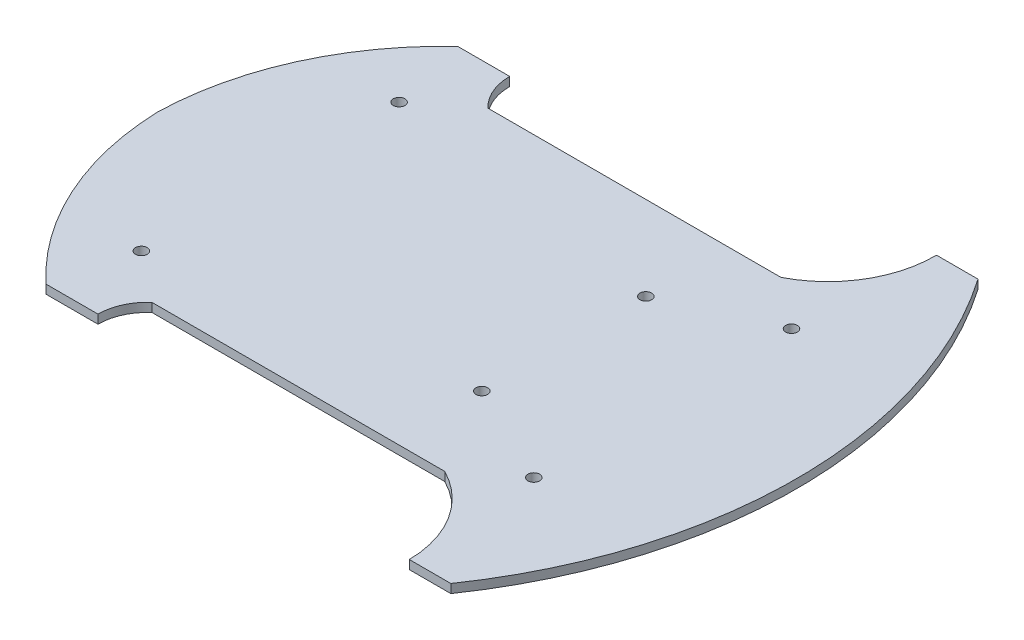
ISO-10303-21;
HEADER;
FILE_DESCRIPTION(('STEP AP214'),'2;1');
FILE_NAME('part.step','',(''),(''),'','','');
FILE_SCHEMA(('AUTOMOTIVE_DESIGN { 1 0 10303 214 1 1 1 1 }'));
ENDSEC;
DATA;
#1=APPLICATION_CONTEXT('core data for automotive mechanical design processes');
#2=APPLICATION_PROTOCOL_DEFINITION('international standard','automotive_design',2000,#1);
#3=PRODUCT_CONTEXT('',#1,'mechanical');
#4=PRODUCT('Part','Part','',(#3));
#5=PRODUCT_RELATED_PRODUCT_CATEGORY('part','',(#4));
#6=PRODUCT_DEFINITION_FORMATION('','',#4);
#7=PRODUCT_DEFINITION_CONTEXT('part definition',#1,'design');
#8=PRODUCT_DEFINITION('design','',#6,#7);
#9=PRODUCT_DEFINITION_SHAPE('','',#8);
#10=(LENGTH_UNIT() NAMED_UNIT(*) SI_UNIT(.MILLI.,.METRE.));
#11=(NAMED_UNIT(*) PLANE_ANGLE_UNIT() SI_UNIT($,.RADIAN.));
#12=(NAMED_UNIT(*) SI_UNIT($,.STERADIAN.) SOLID_ANGLE_UNIT());
#13=UNCERTAINTY_MEASURE_WITH_UNIT(LENGTH_MEASURE(1.E-05),#10,'distance_accuracy_value','');
#14=(GEOMETRIC_REPRESENTATION_CONTEXT(3) GLOBAL_UNCERTAINTY_ASSIGNED_CONTEXT((#13)) GLOBAL_UNIT_ASSIGNED_CONTEXT((#10,
#11,#12)) REPRESENTATION_CONTEXT('',''));
#15=CARTESIAN_POINT('',(0.,0.,0.));
#16=DIRECTION('',(0.,0.,1.));
#17=DIRECTION('',(1.,0.,0.));
#18=AXIS2_PLACEMENT_3D('',#15,#16,#17);
#19=CARTESIAN_POINT('',(-45.3861300946608,3.,0.));
#20=DIRECTION('',(0.,-1.,0.));
#21=DIRECTION('',(0.,0.,-1.));
#22=AXIS2_PLACEMENT_3D('',#19,#20,#21);
#23=PLANE('',#22);
#24=CARTESIAN_POINT('',(-45.3861300946608,3.,0.));
#25=DIRECTION('',(0.,-1.,0.));
#26=DIRECTION('',(0.,0.,-1.));
#27=AXIS2_PLACEMENT_3D('',#24,#25,#26);
#28=CIRCLE('',#27,158.431508611961);
#29=CARTESIAN_POINT('',(85.,3.,-90.));
#30=VERTEX_POINT('',#29);
#31=CARTESIAN_POINT('',(85.,3.,90.));
#32=VERTEX_POINT('',#31);
#33=EDGE_CURVE('E449',#30,#32,#28,.T.);
#34=ORIENTED_EDGE('',*,*,#33,.F.);
#35=DIRECTION('',(-1.,0.,0.));
#36=VECTOR('',#35,1.);
#37=CARTESIAN_POINT('',(85.,3.,-90.));
#38=LINE('',#37,#36);
#39=CARTESIAN_POINT('',(70.8289868960184,3.,-90.));
#40=VERTEX_POINT('',#39);
#41=EDGE_CURVE('E396',#30,#40,#38,.T.);
#42=ORIENTED_EDGE('',*,*,#41,.T.);
#43=CARTESIAN_POINT('',(34.2423694029006,3.,-89.4924866738382));
#44=DIRECTION('',(0.,-1.,0.));
#45=DIRECTION('',(0.,0.,-1.));
#46=AXIS2_PLACEMENT_3D('',#43,#44,#45);
#47=CIRCLE('',#46,36.5901373236552);
#48=CARTESIAN_POINT('',(50.8289868960184,3.,-56.8777312784509));
#49=VERTEX_POINT('',#48);
#50=EDGE_CURVE('E388',#40,#49,#47,.T.);
#51=ORIENTED_EDGE('',*,*,#50,.T.);
#52=DIRECTION('',(1.,0.,0.));
#53=VECTOR('',#52,1.);
#54=CARTESIAN_POINT('',(-49.1710131039816,3.,-56.8777312784509));
#55=LINE('',#54,#53);
#56=CARTESIAN_POINT('',(-49.1710131039816,3.,-56.8777312784509));
#57=VERTEX_POINT('',#56);
#58=EDGE_CURVE('E394',#57,#49,#55,.T.);
#59=ORIENTED_EDGE('',*,*,#58,.F.);
#60=CARTESIAN_POINT('',(-36.9878175930842,3.,-70.));
#61=DIRECTION('',(0.,1.,0.));
#62=DIRECTION('',(0.,0.,1.));
#63=AXIS2_PLACEMENT_3D('',#60,#61,#62);
#64=CIRCLE('',#63,17.9059819406057);
#65=CARTESIAN_POINT('',(-54.8937995336899,3.,-70.));
#66=VERTEX_POINT('',#65);
#67=EDGE_CURVE('E410',#66,#57,#64,.T.);
#68=ORIENTED_EDGE('',*,*,#67,.F.);
#69=DIRECTION('',(1.,0.,0.));
#70=VECTOR('',#69,1.);
#71=CARTESIAN_POINT('',(-72.6123353413881,3.,-70.));
#72=LINE('',#71,#70);
#73=CARTESIAN_POINT('',(-72.6123353413881,3.,-70.));
#74=VERTEX_POINT('',#73);
#75=EDGE_CURVE('E412',#74,#66,#72,.T.);
#76=ORIENTED_EDGE('',*,*,#75,.F.);
#77=CARTESIAN_POINT('',(-4.51996845566921,3.,3.23543931663575));
#78=DIRECTION('',(0.,-1.,0.));
#79=DIRECTION('',(0.,0.,-1.));
#80=AXIS2_PLACEMENT_3D('',#77,#78,#79);
#81=CIRCLE('',#80,100.);
#82=CARTESIAN_POINT('',(-104.482802469838,3.,0.509303616453214));
#83=VERTEX_POINT('',#82);
#84=EDGE_CURVE('E484',#83,#74,#81,.T.);
#85=ORIENTED_EDGE('',*,*,#84,.F.);
#86=CARTESIAN_POINT('',(-4.53320105747436,3.,-2.66515342526299));
#87=DIRECTION('',(0.,-1.,0.));
#88=DIRECTION('',(0.,0.,-1.));
#89=AXIS2_PLACEMENT_3D('',#86,#87,#88);
#90=CIRCLE('',#89,99.9999999999999);
#91=CARTESIAN_POINT('',(-72.6123353413881,3.,70.5825869846147));
#92=VERTEX_POINT('',#91);
#93=EDGE_CURVE('E485',#92,#83,#90,.T.);
#94=ORIENTED_EDGE('',*,*,#93,.F.);
#95=DIRECTION('',(1.,0.,0.));
#96=VECTOR('',#95,1.);
#97=CARTESIAN_POINT('',(-72.6123353413881,3.,70.5825869846147));
#98=LINE('',#97,#96);
#99=CARTESIAN_POINT('',(-54.8937995336899,3.,70.5825869846147));
#100=VERTEX_POINT('',#99);
#101=EDGE_CURVE('E490',#92,#100,#98,.T.);
#102=ORIENTED_EDGE('',*,*,#101,.T.);
#103=CARTESIAN_POINT('',(-37.9709956492232,3.,70.5825869846147));
#104=DIRECTION('',(0.,-1.,0.));
#105=DIRECTION('',(0.,0.,-1.));
#106=AXIS2_PLACEMENT_3D('',#103,#104,#105);
#107=CIRCLE('',#106,16.9228038844667);
#108=CARTESIAN_POINT('',(-49.1710131039816,3.,57.8963385113572));
#109=VERTEX_POINT('',#108);
#110=EDGE_CURVE('E492',#100,#109,#107,.T.);
#111=ORIENTED_EDGE('',*,*,#110,.T.);
#112=DIRECTION('',(1.,0.,0.));
#113=VECTOR('',#112,1.);
#114=CARTESIAN_POINT('',(-49.1710131039816,3.,57.8963385113572));
#115=LINE('',#114,#113);
#116=CARTESIAN_POINT('',(50.8289868960184,3.,57.8963385113572));
#117=VERTEX_POINT('',#116);
#118=EDGE_CURVE('E494',#109,#117,#115,.T.);
#119=ORIENTED_EDGE('',*,*,#118,.T.);
#120=CARTESIAN_POINT('',(34.2388495723633,3.,90.5093036164531));
#121=DIRECTION('',(0.,1.,0.));
#122=DIRECTION('',(0.,0.,1.));
#123=AXIS2_PLACEMENT_3D('',#120,#121,#122);
#124=CIRCLE('',#123,36.5901373236551);
#125=CARTESIAN_POINT('',(70.8254421875578,3.,90.));
#126=VERTEX_POINT('',#125);
#127=EDGE_CURVE('E496',#126,#117,#124,.T.);
#128=ORIENTED_EDGE('',*,*,#127,.F.);
#129=DIRECTION('',(-1.,0.,0.));
#130=VECTOR('',#129,1.);
#131=CARTESIAN_POINT('',(85.,3.,90.));
#132=LINE('',#131,#130);
#133=EDGE_CURVE('E499',#32,#126,#132,.T.);
#134=ORIENTED_EDGE('',*,*,#133,.F.);
#135=EDGE_LOOP('',(#34,#42,#51,#59,#68,#76,#85,#94,#102,#111,#119,#128,#134));
#136=FACE_BOUND('',#135,.T.);
#137=CARTESIAN_POINT('',(-66.1710131039816,3.,-43.4906963835468));
#138=DIRECTION('',(0.,1.,0.));
#139=DIRECTION('',(0.,0.,1.));
#140=AXIS2_PLACEMENT_3D('',#137,#138,#139);
#141=CIRCLE('',#140,2.);
#142=CARTESIAN_POINT('',(-66.1710131039816,3.,-41.4906963835468));
#143=VERTEX_POINT('',#142);
#144=EDGE_CURVE('E421',#143,#143,#141,.T.);
#145=ORIENTED_EDGE('',*,*,#144,.F.);
#146=EDGE_LOOP('',(#145));
#147=FACE_BOUND('',#146,.T.);
#148=CARTESIAN_POINT('',(67.8289868960184,3.,44.5093036164532));
#149=DIRECTION('',(0.,1.,0.));
#150=DIRECTION('',(0.,0.,1.));
#151=AXIS2_PLACEMENT_3D('',#148,#149,#150);
#152=CIRCLE('',#151,2.);
#153=CARTESIAN_POINT('',(67.8289868960184,3.,46.5093036164531));
#154=VERTEX_POINT('',#153);
#155=EDGE_CURVE('E505',#154,#154,#152,.T.);
#156=ORIENTED_EDGE('',*,*,#155,.F.);
#157=EDGE_LOOP('',(#156));
#158=FACE_BOUND('',#157,.T.);
#159=CARTESIAN_POINT('',(67.8289868960184,3.,-43.4906963835468));
#160=DIRECTION('',(0.,1.,0.));
#161=DIRECTION('',(0.,0.,1.));
#162=AXIS2_PLACEMENT_3D('',#159,#160,#161);
#163=CIRCLE('',#162,2.);
#164=CARTESIAN_POINT('',(67.8289868960184,3.,-41.4906963835468));
#165=VERTEX_POINT('',#164);
#166=EDGE_CURVE('E511',#165,#165,#163,.T.);
#167=ORIENTED_EDGE('',*,*,#166,.F.);
#168=EDGE_LOOP('',(#167));
#169=FACE_BOUND('',#168,.T.);
#170=CARTESIAN_POINT('',(-66.1710131039816,3.,44.5093036164532));
#171=DIRECTION('',(0.,1.,0.));
#172=DIRECTION('',(0.,0.,1.));
#173=AXIS2_PLACEMENT_3D('',#170,#171,#172);
#174=CIRCLE('',#173,2.);
#175=CARTESIAN_POINT('',(-66.1710131039816,3.,46.5093036164532));
#176=VERTEX_POINT('',#175);
#177=EDGE_CURVE('E517',#176,#176,#174,.T.);
#178=ORIENTED_EDGE('',*,*,#177,.F.);
#179=EDGE_LOOP('',(#178));
#180=FACE_BOUND('',#179,.T.);
#181=CARTESIAN_POINT('',(33.4017577541302,3.,27.8209693536068));
#182=DIRECTION('',(0.,1.,0.));
#183=DIRECTION('',(0.,0.,1.));
#184=AXIS2_PLACEMENT_3D('',#181,#182,#183);
#185=CIRCLE('',#184,2.);
#186=CARTESIAN_POINT('',(33.4017577541302,3.,29.8209693536068));
#187=VERTEX_POINT('',#186);
#188=EDGE_CURVE('E523',#187,#187,#185,.T.);
#189=ORIENTED_EDGE('',*,*,#188,.F.);
#190=EDGE_LOOP('',(#189));
#191=FACE_BOUND('',#190,.T.);
#192=CARTESIAN_POINT('',(33.4017577541302,3.,-28.1790306463932));
#193=DIRECTION('',(0.,1.,0.));
#194=DIRECTION('',(0.,0.,1.));
#195=AXIS2_PLACEMENT_3D('',#192,#193,#194);
#196=CIRCLE('',#195,2.);
#197=CARTESIAN_POINT('',(33.4017577541302,3.,-26.1790306463932));
#198=VERTEX_POINT('',#197);
#199=EDGE_CURVE('E529',#198,#198,#196,.T.);
#200=ORIENTED_EDGE('',*,*,#199,.F.);
#201=EDGE_LOOP('',(#200));
#202=FACE_BOUND('',#201,.T.);
#203=ADVANCED_FACE('F287',(#136,#147,#158,#169,#180,#191,#202),#23,.F.);
#204=CARTESIAN_POINT('',(-45.3861300946608,0.,0.));
#205=DIRECTION('',(0.,-1.,0.));
#206=DIRECTION('',(0.,0.,-1.));
#207=AXIS2_PLACEMENT_3D('',#204,#205,#206);
#208=PLANE('',#207);
#209=CARTESIAN_POINT('',(33.4017577541302,0.,27.8209693536068));
#210=DIRECTION('',(0.,1.,0.));
#211=DIRECTION('',(0.,0.,1.));
#212=AXIS2_PLACEMENT_3D('',#209,#210,#211);
#213=CIRCLE('',#212,2.);
#214=CARTESIAN_POINT('',(33.4017577541302,0.,29.8209693536068));
#215=VERTEX_POINT('',#214);
#216=EDGE_CURVE('E526',#215,#215,#213,.T.);
#217=ORIENTED_EDGE('',*,*,#216,.T.);
#218=EDGE_LOOP('',(#217));
#219=FACE_BOUND('',#218,.T.);
#220=CARTESIAN_POINT('',(67.8289868960184,0.,-43.4906963835468));
#221=DIRECTION('',(0.,1.,0.));
#222=DIRECTION('',(0.,0.,1.));
#223=AXIS2_PLACEMENT_3D('',#220,#221,#222);
#224=CIRCLE('',#223,2.);
#225=CARTESIAN_POINT('',(67.8289868960184,0.,-41.4906963835468));
#226=VERTEX_POINT('',#225);
#227=EDGE_CURVE('E514',#226,#226,#224,.T.);
#228=ORIENTED_EDGE('',*,*,#227,.T.);
#229=EDGE_LOOP('',(#228));
#230=FACE_BOUND('',#229,.T.);
#231=CARTESIAN_POINT('',(-66.1710131039816,0.,-43.4906963835468));
#232=DIRECTION('',(0.,1.,0.));
#233=DIRECTION('',(0.,0.,1.));
#234=AXIS2_PLACEMENT_3D('',#231,#232,#233);
#235=CIRCLE('',#234,2.);
#236=CARTESIAN_POINT('',(-66.1710131039816,0.,-41.4906963835468));
#237=VERTEX_POINT('',#236);
#238=EDGE_CURVE('E502',#237,#237,#235,.T.);
#239=ORIENTED_EDGE('',*,*,#238,.T.);
#240=EDGE_LOOP('',(#239));
#241=FACE_BOUND('',#240,.T.);
#242=CARTESIAN_POINT('',(-45.3861300946608,0.,0.));
#243=DIRECTION('',(0.,-1.,0.));
#244=DIRECTION('',(0.,0.,-1.));
#245=AXIS2_PLACEMENT_3D('',#242,#243,#244);
#246=CIRCLE('',#245,158.431508611961);
#247=CARTESIAN_POINT('',(85.,0.,-90.));
#248=VERTEX_POINT('',#247);
#249=CARTESIAN_POINT('',(85.,0.,90.));
#250=VERTEX_POINT('',#249);
#251=EDGE_CURVE('E417',#248,#250,#246,.T.);
#252=ORIENTED_EDGE('',*,*,#251,.T.);
#253=DIRECTION('',(-1.,0.,0.));
#254=VECTOR('',#253,1.);
#255=CARTESIAN_POINT('',(85.,0.,90.));
#256=LINE('',#255,#254);
#257=CARTESIAN_POINT('',(70.8254421875578,0.,90.));
#258=VERTEX_POINT('',#257);
#259=EDGE_CURVE('E420',#250,#258,#256,.T.);
#260=ORIENTED_EDGE('',*,*,#259,.T.);
#261=CARTESIAN_POINT('',(34.2388495723633,0.,90.5093036164531));
#262=DIRECTION('',(0.,1.,0.));
#263=DIRECTION('',(0.,0.,1.));
#264=AXIS2_PLACEMENT_3D('',#261,#262,#263);
#265=CIRCLE('',#264,36.5901373236551);
#266=CARTESIAN_POINT('',(50.8289868960184,0.,57.8963385113572));
#267=VERTEX_POINT('',#266);
#268=EDGE_CURVE('E424',#258,#267,#265,.T.);
#269=ORIENTED_EDGE('',*,*,#268,.T.);
#270=DIRECTION('',(1.,0.,0.));
#271=VECTOR('',#270,1.);
#272=CARTESIAN_POINT('',(-49.1710131039816,0.,57.8963385113572));
#273=LINE('',#272,#271);
#274=CARTESIAN_POINT('',(-49.1710131039816,0.,57.8963385113572));
#275=VERTEX_POINT('',#274);
#276=EDGE_CURVE('E427',#275,#267,#273,.T.);
#277=ORIENTED_EDGE('',*,*,#276,.F.);
#278=CARTESIAN_POINT('',(-37.9709956492232,0.,70.5825869846147));
#279=DIRECTION('',(0.,-1.,0.));
#280=DIRECTION('',(0.,0.,-1.));
#281=AXIS2_PLACEMENT_3D('',#278,#279,#280);
#282=CIRCLE('',#281,16.9228038844667);
#283=CARTESIAN_POINT('',(-54.8937995336899,0.,70.5825869846147));
#284=VERTEX_POINT('',#283);
#285=EDGE_CURVE('E430',#284,#275,#282,.T.);
#286=ORIENTED_EDGE('',*,*,#285,.F.);
#287=DIRECTION('',(1.,0.,0.));
#288=VECTOR('',#287,1.);
#289=CARTESIAN_POINT('',(-72.6123353413881,0.,70.5825869846147));
#290=LINE('',#289,#288);
#291=CARTESIAN_POINT('',(-72.6123353413881,0.,70.5825869846147));
#292=VERTEX_POINT('',#291);
#293=EDGE_CURVE('E432',#292,#284,#290,.T.);
#294=ORIENTED_EDGE('',*,*,#293,.F.);
#295=CARTESIAN_POINT('',(-4.53320105747436,0.,-2.66515342526299));
#296=DIRECTION('',(0.,-1.,0.));
#297=DIRECTION('',(0.,0.,-1.));
#298=AXIS2_PLACEMENT_3D('',#295,#296,#297);
#299=CIRCLE('',#298,99.9999999999999);
#300=CARTESIAN_POINT('',(-104.482802469838,0.,0.509303616453214));
#301=VERTEX_POINT('',#300);
#302=EDGE_CURVE('E434',#292,#301,#299,.T.);
#303=ORIENTED_EDGE('',*,*,#302,.T.);
#304=CARTESIAN_POINT('',(-4.51996845566921,0.,3.23543931663575));
#305=DIRECTION('',(0.,-1.,0.));
#306=DIRECTION('',(0.,0.,-1.));
#307=AXIS2_PLACEMENT_3D('',#304,#305,#306);
#308=CIRCLE('',#307,100.);
#309=CARTESIAN_POINT('',(-72.6123353413881,0.,-70.));
#310=VERTEX_POINT('',#309);
#311=EDGE_CURVE('E437',#301,#310,#308,.T.);
#312=ORIENTED_EDGE('',*,*,#311,.T.);
#313=DIRECTION('',(1.,0.,0.));
#314=VECTOR('',#313,1.);
#315=CARTESIAN_POINT('',(-72.6123353413881,0.,-70.));
#316=LINE('',#315,#314);
#317=CARTESIAN_POINT('',(-54.8937995336899,0.,-70.));
#318=VERTEX_POINT('',#317);
#319=EDGE_CURVE('E440',#310,#318,#316,.T.);
#320=ORIENTED_EDGE('',*,*,#319,.T.);
#321=CARTESIAN_POINT('',(-36.9878175930842,0.,-70.));
#322=DIRECTION('',(0.,1.,0.));
#323=DIRECTION('',(0.,0.,1.));
#324=AXIS2_PLACEMENT_3D('',#321,#322,#323);
#325=CIRCLE('',#324,17.9059819406057);
#326=CARTESIAN_POINT('',(-49.1710131039816,0.,-56.8777312784509));
#327=VERTEX_POINT('',#326);
#328=EDGE_CURVE('E443',#318,#327,#325,.T.);
#329=ORIENTED_EDGE('',*,*,#328,.T.);
#330=DIRECTION('',(1.,0.,0.));
#331=VECTOR('',#330,1.);
#332=CARTESIAN_POINT('',(-49.1710131039816,0.,-56.8777312784509));
#333=LINE('',#332,#331);
#334=CARTESIAN_POINT('',(50.8289868960184,0.,-56.8777312784509));
#335=VERTEX_POINT('',#334);
#336=EDGE_CURVE('E446',#327,#335,#333,.T.);
#337=ORIENTED_EDGE('',*,*,#336,.T.);
#338=CARTESIAN_POINT('',(34.2423694029006,0.,-89.4924866738382));
#339=DIRECTION('',(0.,-1.,0.));
#340=DIRECTION('',(0.,0.,-1.));
#341=AXIS2_PLACEMENT_3D('',#338,#339,#340);
#342=CIRCLE('',#341,36.5901373236552);
#343=CARTESIAN_POINT('',(70.8289868960184,0.,-90.));
#344=VERTEX_POINT('',#343);
#345=EDGE_CURVE('E403',#344,#335,#342,.T.);
#346=ORIENTED_EDGE('',*,*,#345,.F.);
#347=DIRECTION('',(-1.,0.,0.));
#348=VECTOR('',#347,1.);
#349=CARTESIAN_POINT('',(85.,0.,-90.));
#350=LINE('',#349,#348);
#351=EDGE_CURVE('E348',#248,#344,#350,.T.);
#352=ORIENTED_EDGE('',*,*,#351,.F.);
#353=EDGE_LOOP('',(#252,#260,#269,#277,#286,#294,#303,#312,#320,#329,#337,#346,#352));
#354=FACE_BOUND('',#353,.T.);
#355=CARTESIAN_POINT('',(67.8289868960184,0.,44.5093036164532));
#356=DIRECTION('',(0.,1.,0.));
#357=DIRECTION('',(0.,0.,1.));
#358=AXIS2_PLACEMENT_3D('',#355,#356,#357);
#359=CIRCLE('',#358,2.);
#360=CARTESIAN_POINT('',(67.8289868960184,0.,46.5093036164531));
#361=VERTEX_POINT('',#360);
#362=EDGE_CURVE('E508',#361,#361,#359,.T.);
#363=ORIENTED_EDGE('',*,*,#362,.T.);
#364=EDGE_LOOP('',(#363));
#365=FACE_BOUND('',#364,.T.);
#366=CARTESIAN_POINT('',(-66.1710131039816,0.,44.5093036164532));
#367=DIRECTION('',(0.,1.,0.));
#368=DIRECTION('',(0.,0.,1.));
#369=AXIS2_PLACEMENT_3D('',#366,#367,#368);
#370=CIRCLE('',#369,2.);
#371=CARTESIAN_POINT('',(-66.1710131039816,0.,46.5093036164532));
#372=VERTEX_POINT('',#371);
#373=EDGE_CURVE('E520',#372,#372,#370,.T.);
#374=ORIENTED_EDGE('',*,*,#373,.T.);
#375=EDGE_LOOP('',(#374));
#376=FACE_BOUND('',#375,.T.);
#377=CARTESIAN_POINT('',(33.4017577541302,0.,-28.1790306463932));
#378=DIRECTION('',(0.,1.,0.));
#379=DIRECTION('',(0.,0.,1.));
#380=AXIS2_PLACEMENT_3D('',#377,#378,#379);
#381=CIRCLE('',#380,2.);
#382=CARTESIAN_POINT('',(33.4017577541302,0.,-26.1790306463932));
#383=VERTEX_POINT('',#382);
#384=EDGE_CURVE('E532',#383,#383,#381,.T.);
#385=ORIENTED_EDGE('',*,*,#384,.T.);
#386=EDGE_LOOP('',(#385));
#387=FACE_BOUND('',#386,.T.);
#388=ADVANCED_FACE('F472',(#219,#230,#241,#354,#365,#376,#387),#208,.T.);
#389=CARTESIAN_POINT('',(-45.3861300946608,3.,0.));
#390=DIRECTION('',(0.,-1.,0.));
#391=DIRECTION('',(0.,0.,-1.));
#392=AXIS2_PLACEMENT_3D('',#389,#390,#391);
#393=CYLINDRICAL_SURFACE('',#392,158.431508611961);
#394=ORIENTED_EDGE('',*,*,#251,.F.);
#395=DIRECTION('',(0.,-1.,0.));
#396=VECTOR('',#395,1.);
#397=CARTESIAN_POINT('',(85.,3.,-90.));
#398=LINE('',#397,#396);
#399=EDGE_CURVE('E12',#30,#248,#398,.T.);
#400=ORIENTED_EDGE('',*,*,#399,.F.);
#401=ORIENTED_EDGE('',*,*,#33,.T.);
#402=DIRECTION('',(0.,-1.,0.));
#403=VECTOR('',#402,1.);
#404=CARTESIAN_POINT('',(85.,3.,90.));
#405=LINE('',#404,#403);
#406=EDGE_CURVE('E291',#32,#250,#405,.T.);
#407=ORIENTED_EDGE('',*,*,#406,.T.);
#408=EDGE_LOOP('',(#394,#400,#401,#407));
#409=FACE_BOUND('',#408,.T.);
#410=ADVANCED_FACE('F289',(#409),#393,.T.);
#411=CARTESIAN_POINT('',(85.,3.,-90.));
#412=DIRECTION('',(0.,0.,1.));
#413=DIRECTION('',(1.,0.,0.));
#414=AXIS2_PLACEMENT_3D('',#411,#412,#413);
#415=PLANE('',#414);
#416=ORIENTED_EDGE('',*,*,#351,.T.);
#417=DIRECTION('',(0.,-1.,0.));
#418=VECTOR('',#417,1.);
#419=CARTESIAN_POINT('',(70.8289868960184,3.,-90.));
#420=LINE('',#419,#418);
#421=EDGE_CURVE('E297',#40,#344,#420,.T.);
#422=ORIENTED_EDGE('',*,*,#421,.F.);
#423=ORIENTED_EDGE('',*,*,#41,.F.);
#424=ORIENTED_EDGE('',*,*,#399,.T.);
#425=EDGE_LOOP('',(#416,#422,#423,#424));
#426=FACE_BOUND('',#425,.T.);
#427=ADVANCED_FACE('F552',(#426),#415,.F.);
#428=CARTESIAN_POINT('',(34.2423694029006,3.,-89.4924866738382));
#429=DIRECTION('',(0.,-1.,0.));
#430=DIRECTION('',(0.,0.,-1.));
#431=AXIS2_PLACEMENT_3D('',#428,#429,#430);
#432=CYLINDRICAL_SURFACE('',#431,36.5901373236552);
#433=ORIENTED_EDGE('',*,*,#345,.T.);
#434=DIRECTION('',(0.,-1.,0.));
#435=VECTOR('',#434,1.);
#436=CARTESIAN_POINT('',(50.8289868960184,3.,-56.8777312784509));
#437=LINE('',#436,#435);
#438=EDGE_CURVE('E400',#49,#335,#437,.T.);
#439=ORIENTED_EDGE('',*,*,#438,.F.);
#440=ORIENTED_EDGE('',*,*,#50,.F.);
#441=ORIENTED_EDGE('',*,*,#421,.T.);
#442=EDGE_LOOP('',(#433,#439,#440,#441));
#443=FACE_BOUND('',#442,.T.);
#444=ADVANCED_FACE('F401',(#443),#432,.F.);
#445=CARTESIAN_POINT('',(-49.1710131039816,3.,-56.8777312784509));
#446=DIRECTION('',(0.,0.,-1.));
#447=DIRECTION('',(-1.,0.,0.));
#448=AXIS2_PLACEMENT_3D('',#445,#446,#447);
#449=PLANE('',#448);
#450=ORIENTED_EDGE('',*,*,#336,.F.);
#451=DIRECTION('',(0.,-1.,0.));
#452=VECTOR('',#451,1.);
#453=CARTESIAN_POINT('',(-49.1710131039816,3.,-56.8777312784509));
#454=LINE('',#453,#452);
#455=EDGE_CURVE('E407',#57,#327,#454,.T.);
#456=ORIENTED_EDGE('',*,*,#455,.F.);
#457=ORIENTED_EDGE('',*,*,#58,.T.);
#458=ORIENTED_EDGE('',*,*,#438,.T.);
#459=EDGE_LOOP('',(#450,#456,#457,#458));
#460=FACE_BOUND('',#459,.T.);
#461=ADVANCED_FACE('F409',(#460),#449,.T.);
#462=CARTESIAN_POINT('',(-36.9878175930842,3.,-70.));
#463=DIRECTION('',(0.,-1.,0.));
#464=DIRECTION('',(0.,0.,-1.));
#465=AXIS2_PLACEMENT_3D('',#462,#463,#464);
#466=CYLINDRICAL_SURFACE('',#465,17.9059819406057);
#467=ORIENTED_EDGE('',*,*,#328,.F.);
#468=DIRECTION('',(0.,-1.,0.));
#469=VECTOR('',#468,1.);
#470=CARTESIAN_POINT('',(-54.8937995336899,3.,-70.));
#471=LINE('',#470,#469);
#472=EDGE_CURVE('E453',#66,#318,#471,.T.);
#473=ORIENTED_EDGE('',*,*,#472,.F.);
#474=ORIENTED_EDGE('',*,*,#67,.T.);
#475=ORIENTED_EDGE('',*,*,#455,.T.);
#476=EDGE_LOOP('',(#467,#473,#474,#475));
#477=FACE_BOUND('',#476,.T.);
#478=ADVANCED_FACE('F477',(#477),#466,.F.);
#479=CARTESIAN_POINT('',(-72.6123353413881,3.,-70.));
#480=DIRECTION('',(0.,0.,-1.));
#481=DIRECTION('',(-1.,0.,0.));
#482=AXIS2_PLACEMENT_3D('',#479,#480,#481);
#483=PLANE('',#482);
#484=ORIENTED_EDGE('',*,*,#319,.F.);
#485=DIRECTION('',(0.,-1.,0.));
#486=VECTOR('',#485,1.);
#487=CARTESIAN_POINT('',(-72.6123353413881,3.,-70.));
#488=LINE('',#487,#486);
#489=EDGE_CURVE('E455',#74,#310,#488,.T.);
#490=ORIENTED_EDGE('',*,*,#489,.F.);
#491=ORIENTED_EDGE('',*,*,#75,.T.);
#492=ORIENTED_EDGE('',*,*,#472,.T.);
#493=EDGE_LOOP('',(#484,#490,#491,#492));
#494=FACE_BOUND('',#493,.T.);
#495=ADVANCED_FACE('F483',(#494),#483,.T.);
#496=CARTESIAN_POINT('',(-4.51996845566921,3.,3.23543931663575));
#497=DIRECTION('',(0.,-1.,0.));
#498=DIRECTION('',(0.,0.,-1.));
#499=AXIS2_PLACEMENT_3D('',#496,#497,#498);
#500=CYLINDRICAL_SURFACE('',#499,100.);
#501=ORIENTED_EDGE('',*,*,#311,.F.);
#502=DIRECTION('',(0.,-1.,0.));
#503=VECTOR('',#502,1.);
#504=CARTESIAN_POINT('',(-104.482802469838,3.,0.509303616453214));
#505=LINE('',#504,#503);
#506=EDGE_CURVE('E457',#83,#301,#505,.T.);
#507=ORIENTED_EDGE('',*,*,#506,.F.);
#508=ORIENTED_EDGE('',*,*,#84,.T.);
#509=ORIENTED_EDGE('',*,*,#489,.T.);
#510=EDGE_LOOP('',(#501,#507,#508,#509));
#511=FACE_BOUND('',#510,.T.);
#512=ADVANCED_FACE('F563',(#511),#500,.T.);
#513=CARTESIAN_POINT('',(-4.53320105747436,3.,-2.66515342526299));
#514=DIRECTION('',(0.,-1.,0.));
#515=DIRECTION('',(0.,0.,-1.));
#516=AXIS2_PLACEMENT_3D('',#513,#514,#515);
#517=CYLINDRICAL_SURFACE('',#516,99.9999999999999);
#518=ORIENTED_EDGE('',*,*,#302,.F.);
#519=DIRECTION('',(0.,-1.,0.));
#520=VECTOR('',#519,1.);
#521=CARTESIAN_POINT('',(-72.6123353413881,3.,70.5825869846147));
#522=LINE('',#521,#520);
#523=EDGE_CURVE('E459',#92,#292,#522,.T.);
#524=ORIENTED_EDGE('',*,*,#523,.F.);
#525=ORIENTED_EDGE('',*,*,#93,.T.);
#526=ORIENTED_EDGE('',*,*,#506,.T.);
#527=EDGE_LOOP('',(#518,#524,#525,#526));
#528=FACE_BOUND('',#527,.T.);
#529=ADVANCED_FACE('F566',(#528),#517,.T.);
#530=CARTESIAN_POINT('',(-72.6123353413881,3.,70.5825869846147));
#531=DIRECTION('',(0.,0.,-1.));
#532=DIRECTION('',(-1.,0.,0.));
#533=AXIS2_PLACEMENT_3D('',#530,#531,#532);
#534=PLANE('',#533);
#535=ORIENTED_EDGE('',*,*,#293,.T.);
#536=DIRECTION('',(0.,-1.,0.));
#537=VECTOR('',#536,1.);
#538=CARTESIAN_POINT('',(-54.8937995336899,3.,70.5825869846147));
#539=LINE('',#538,#537);
#540=EDGE_CURVE('E461',#100,#284,#539,.T.);
#541=ORIENTED_EDGE('',*,*,#540,.F.);
#542=ORIENTED_EDGE('',*,*,#101,.F.);
#543=ORIENTED_EDGE('',*,*,#523,.T.);
#544=EDGE_LOOP('',(#535,#541,#542,#543));
#545=FACE_BOUND('',#544,.T.);
#546=ADVANCED_FACE('F570',(#545),#534,.F.);
#547=CARTESIAN_POINT('',(-37.9709956492232,3.,70.5825869846147));
#548=DIRECTION('',(0.,-1.,0.));
#549=DIRECTION('',(0.,0.,-1.));
#550=AXIS2_PLACEMENT_3D('',#547,#548,#549);
#551=CYLINDRICAL_SURFACE('',#550,16.9228038844667);
#552=ORIENTED_EDGE('',*,*,#285,.T.);
#553=DIRECTION('',(0.,-1.,0.));
#554=VECTOR('',#553,1.);
#555=CARTESIAN_POINT('',(-49.1710131039816,3.,57.8963385113572));
#556=LINE('',#555,#554);
#557=EDGE_CURVE('E464',#109,#275,#556,.T.);
#558=ORIENTED_EDGE('',*,*,#557,.F.);
#559=ORIENTED_EDGE('',*,*,#110,.F.);
#560=ORIENTED_EDGE('',*,*,#540,.T.);
#561=EDGE_LOOP('',(#552,#558,#559,#560));
#562=FACE_BOUND('',#561,.T.);
#563=ADVANCED_FACE('F574',(#562),#551,.F.);
#564=CARTESIAN_POINT('',(-49.1710131039816,3.,57.8963385113572));
#565=DIRECTION('',(0.,0.,-1.));
#566=DIRECTION('',(-1.,0.,0.));
#567=AXIS2_PLACEMENT_3D('',#564,#565,#566);
#568=PLANE('',#567);
#569=ORIENTED_EDGE('',*,*,#276,.T.);
#570=DIRECTION('',(0.,-1.,0.));
#571=VECTOR('',#570,1.);
#572=CARTESIAN_POINT('',(50.8289868960184,3.,57.8963385113572));
#573=LINE('',#572,#571);
#574=EDGE_CURVE('E467',#117,#267,#573,.T.);
#575=ORIENTED_EDGE('',*,*,#574,.F.);
#576=ORIENTED_EDGE('',*,*,#118,.F.);
#577=ORIENTED_EDGE('',*,*,#557,.T.);
#578=EDGE_LOOP('',(#569,#575,#576,#577));
#579=FACE_BOUND('',#578,.T.);
#580=ADVANCED_FACE('F578',(#579),#568,.F.);
#581=CARTESIAN_POINT('',(34.2388495723633,3.,90.5093036164531));
#582=DIRECTION('',(0.,-1.,0.));
#583=DIRECTION('',(0.,0.,-1.));
#584=AXIS2_PLACEMENT_3D('',#581,#582,#583);
#585=CYLINDRICAL_SURFACE('',#584,36.5901373236551);
#586=ORIENTED_EDGE('',*,*,#268,.F.);
#587=DIRECTION('',(0.,-1.,0.));
#588=VECTOR('',#587,1.);
#589=CARTESIAN_POINT('',(70.8254421875578,3.,90.));
#590=LINE('',#589,#588);
#591=EDGE_CURVE('E468',#126,#258,#590,.T.);
#592=ORIENTED_EDGE('',*,*,#591,.F.);
#593=ORIENTED_EDGE('',*,*,#127,.T.);
#594=ORIENTED_EDGE('',*,*,#574,.T.);
#595=EDGE_LOOP('',(#586,#592,#593,#594));
#596=FACE_BOUND('',#595,.T.);
#597=ADVANCED_FACE('F582',(#596),#585,.F.);
#598=CARTESIAN_POINT('',(85.,3.,90.));
#599=DIRECTION('',(0.,0.,1.));
#600=DIRECTION('',(1.,0.,0.));
#601=AXIS2_PLACEMENT_3D('',#598,#599,#600);
#602=PLANE('',#601);
#603=ORIENTED_EDGE('',*,*,#259,.F.);
#604=ORIENTED_EDGE('',*,*,#406,.F.);
#605=ORIENTED_EDGE('',*,*,#133,.T.);
#606=ORIENTED_EDGE('',*,*,#591,.T.);
#607=EDGE_LOOP('',(#603,#604,#605,#606));
#608=FACE_BOUND('',#607,.T.);
#609=ADVANCED_FACE('F470',(#608),#602,.T.);
#610=CARTESIAN_POINT('',(-66.1710131039816,3.,-43.4906963835468));
#611=DIRECTION('',(0.,-1.,0.));
#612=DIRECTION('',(0.,0.,-1.));
#613=AXIS2_PLACEMENT_3D('',#610,#611,#612);
#614=CYLINDRICAL_SURFACE('',#613,2.);
#615=ORIENTED_EDGE('',*,*,#144,.T.);
#616=EDGE_LOOP('',(#615));
#617=FACE_BOUND('',#616,.T.);
#618=ORIENTED_EDGE('',*,*,#238,.F.);
#619=EDGE_LOOP('',(#618));
#620=FACE_BOUND('',#619,.T.);
#621=ADVANCED_FACE('F549',(#617,#620),#614,.F.);
#622=CARTESIAN_POINT('',(67.8289868960184,3.,44.5093036164532));
#623=DIRECTION('',(0.,-1.,0.));
#624=DIRECTION('',(0.,0.,-1.));
#625=AXIS2_PLACEMENT_3D('',#622,#623,#624);
#626=CYLINDRICAL_SURFACE('',#625,2.);
#627=ORIENTED_EDGE('',*,*,#155,.T.);
#628=EDGE_LOOP('',(#627));
#629=FACE_BOUND('',#628,.T.);
#630=ORIENTED_EDGE('',*,*,#362,.F.);
#631=EDGE_LOOP('',(#630));
#632=FACE_BOUND('',#631,.T.);
#633=ADVANCED_FACE('F590',(#629,#632),#626,.F.);
#634=CARTESIAN_POINT('',(67.8289868960184,3.,-43.4906963835468));
#635=DIRECTION('',(0.,-1.,0.));
#636=DIRECTION('',(0.,0.,-1.));
#637=AXIS2_PLACEMENT_3D('',#634,#635,#636);
#638=CYLINDRICAL_SURFACE('',#637,2.);
#639=ORIENTED_EDGE('',*,*,#166,.T.);
#640=EDGE_LOOP('',(#639));
#641=FACE_BOUND('',#640,.T.);
#642=ORIENTED_EDGE('',*,*,#227,.F.);
#643=EDGE_LOOP('',(#642));
#644=FACE_BOUND('',#643,.T.);
#645=ADVANCED_FACE('F595',(#641,#644),#638,.F.);
#646=CARTESIAN_POINT('',(-66.1710131039816,3.,44.5093036164532));
#647=DIRECTION('',(0.,-1.,0.));
#648=DIRECTION('',(0.,0.,-1.));
#649=AXIS2_PLACEMENT_3D('',#646,#647,#648);
#650=CYLINDRICAL_SURFACE('',#649,2.);
#651=ORIENTED_EDGE('',*,*,#177,.T.);
#652=EDGE_LOOP('',(#651));
#653=FACE_BOUND('',#652,.T.);
#654=ORIENTED_EDGE('',*,*,#373,.F.);
#655=EDGE_LOOP('',(#654));
#656=FACE_BOUND('',#655,.T.);
#657=ADVANCED_FACE('F613',(#653,#656),#650,.F.);
#658=CARTESIAN_POINT('',(33.4017577541302,3.,27.8209693536068));
#659=DIRECTION('',(0.,-1.,0.));
#660=DIRECTION('',(0.,0.,-1.));
#661=AXIS2_PLACEMENT_3D('',#658,#659,#660);
#662=CYLINDRICAL_SURFACE('',#661,2.);
#663=ORIENTED_EDGE('',*,*,#188,.T.);
#664=EDGE_LOOP('',(#663));
#665=FACE_BOUND('',#664,.T.);
#666=ORIENTED_EDGE('',*,*,#216,.F.);
#667=EDGE_LOOP('',(#666));
#668=FACE_BOUND('',#667,.T.);
#669=ADVANCED_FACE('F610',(#665,#668),#662,.F.);
#670=CARTESIAN_POINT('',(33.4017577541302,3.,-28.1790306463932));
#671=DIRECTION('',(0.,-1.,0.));
#672=DIRECTION('',(0.,0.,-1.));
#673=AXIS2_PLACEMENT_3D('',#670,#671,#672);
#674=CYLINDRICAL_SURFACE('',#673,2.);
#675=ORIENTED_EDGE('',*,*,#199,.T.);
#676=EDGE_LOOP('',(#675));
#677=FACE_BOUND('',#676,.T.);
#678=ORIENTED_EDGE('',*,*,#384,.F.);
#679=EDGE_LOOP('',(#678));
#680=FACE_BOUND('',#679,.T.);
#681=ADVANCED_FACE('F538',(#677,#680),#674,.F.);
#682=CLOSED_SHELL('',(#203,#388,#410,#427,#444,#461,#478,#495,#512,#529,#546,#563,#580,#597,
#609,#621,#633,#645,#657,#669,#681));
#683=MANIFOLD_SOLID_BREP('B2',#682);
#684=ADVANCED_BREP_SHAPE_REPRESENTATION('',(#18,#683),#14);
#685=SHAPE_DEFINITION_REPRESENTATION(#9,#684);
ENDSEC;
END-ISO-10303-21;
